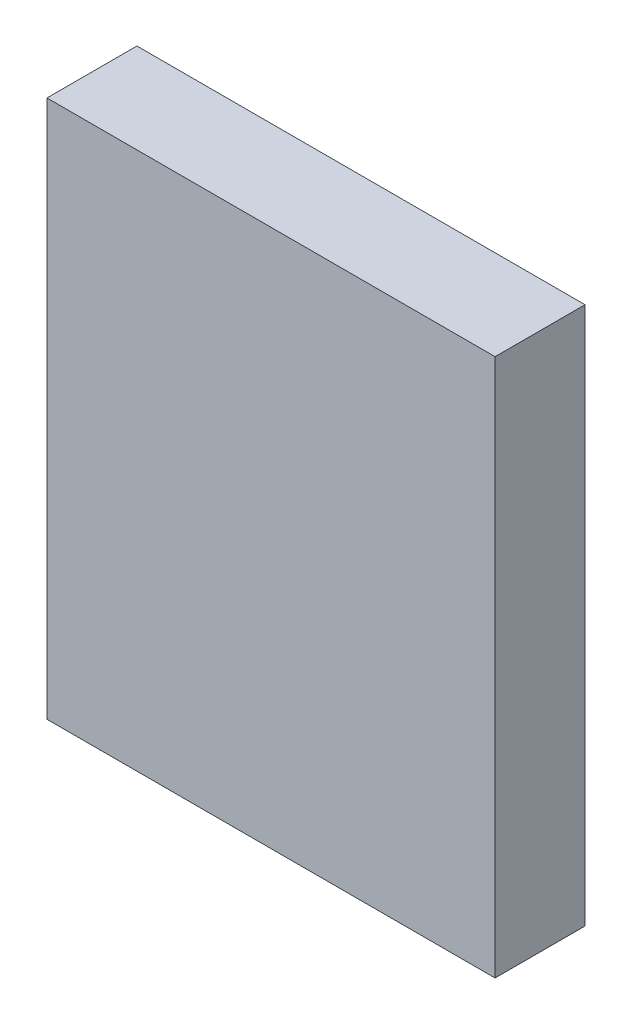
ISO-10303-21;
HEADER;
FILE_DESCRIPTION(('STEP AP214'),'2;1');
FILE_NAME('part.step','',(''),(''),'','','');
FILE_SCHEMA(('AUTOMOTIVE_DESIGN { 1 0 10303 214 1 1 1 1 }'));
ENDSEC;
DATA;
#1=APPLICATION_CONTEXT('core data for automotive mechanical design processes');
#2=APPLICATION_PROTOCOL_DEFINITION('international standard','automotive_design',2000,#1);
#3=PRODUCT_CONTEXT('',#1,'mechanical');
#4=PRODUCT('Part','Part','',(#3));
#5=PRODUCT_RELATED_PRODUCT_CATEGORY('part','',(#4));
#6=PRODUCT_DEFINITION_FORMATION('','',#4);
#7=PRODUCT_DEFINITION_CONTEXT('part definition',#1,'design');
#8=PRODUCT_DEFINITION('design','',#6,#7);
#9=PRODUCT_DEFINITION_SHAPE('','',#8);
#10=(LENGTH_UNIT() NAMED_UNIT(*) SI_UNIT(.MILLI.,.METRE.));
#11=(NAMED_UNIT(*) PLANE_ANGLE_UNIT() SI_UNIT($,.RADIAN.));
#12=(NAMED_UNIT(*) SI_UNIT($,.STERADIAN.) SOLID_ANGLE_UNIT());
#13=UNCERTAINTY_MEASURE_WITH_UNIT(LENGTH_MEASURE(1.E-05),#10,'distance_accuracy_value','');
#14=(GEOMETRIC_REPRESENTATION_CONTEXT(3) GLOBAL_UNCERTAINTY_ASSIGNED_CONTEXT((#13)) GLOBAL_UNIT_ASSIGNED_CONTEXT((#10,
#11,#12)) REPRESENTATION_CONTEXT('',''));
#15=CARTESIAN_POINT('',(0.,0.,0.));
#16=DIRECTION('',(0.,0.,1.));
#17=DIRECTION('',(1.,0.,0.));
#18=AXIS2_PLACEMENT_3D('',#15,#16,#17);
#19=CARTESIAN_POINT('',(0.373,-1.003,0.));
#20=DIRECTION('',(0.,-1.,0.));
#21=DIRECTION('',(0.,0.,1.));
#22=AXIS2_PLACEMENT_3D('',#19,#20,#21);
#23=PLANE('',#22);
#24=DIRECTION('',(-1.,0.,0.));
#25=VECTOR('',#24,1.);
#26=CARTESIAN_POINT('',(0.627,-1.003,0.));
#27=LINE('',#26,#25);
#28=CARTESIAN_POINT('',(0.627,-1.003,0.));
#29=VERTEX_POINT('',#28);
#30=CARTESIAN_POINT('',(0.373,-1.003,0.));
#31=VERTEX_POINT('',#30);
#32=EDGE_CURVE('E11',#29,#31,#27,.T.);
#33=ORIENTED_EDGE('',*,*,#32,.F.);
#34=DIRECTION('',(0.,0.,-1.));
#35=VECTOR('',#34,1.);
#36=CARTESIAN_POINT('',(0.627,-1.003,0.051));
#37=LINE('',#36,#35);
#38=CARTESIAN_POINT('',(0.627,-1.003,0.051));
#39=VERTEX_POINT('',#38);
#40=EDGE_CURVE('E24',#39,#29,#37,.T.);
#41=ORIENTED_EDGE('',*,*,#40,.F.);
#42=DIRECTION('',(1.,0.,0.));
#43=VECTOR('',#42,1.);
#44=CARTESIAN_POINT('',(0.373,-1.003,0.051));
#45=LINE('',#44,#43);
#46=CARTESIAN_POINT('',(0.373,-1.003,0.051));
#47=VERTEX_POINT('',#46);
#48=EDGE_CURVE('E88',#47,#39,#45,.T.);
#49=ORIENTED_EDGE('',*,*,#48,.F.);
#50=DIRECTION('',(0.,0.,1.));
#51=VECTOR('',#50,1.);
#52=CARTESIAN_POINT('',(0.373,-1.003,0.));
#53=LINE('',#52,#51);
#54=EDGE_CURVE('E77',#31,#47,#53,.T.);
#55=ORIENTED_EDGE('',*,*,#54,.F.);
#56=EDGE_LOOP('',(#33,#41,#49,#55));
#57=FACE_BOUND('',#56,.T.);
#58=ADVANCED_FACE('F17',(#57),#23,.T.);
#59=CARTESIAN_POINT('',(0.627,-1.003,0.));
#60=DIRECTION('',(1.,0.,0.));
#61=DIRECTION('',(0.,0.,1.));
#62=AXIS2_PLACEMENT_3D('',#59,#60,#61);
#63=PLANE('',#62);
#64=DIRECTION('',(0.,-1.,0.));
#65=VECTOR('',#64,1.);
#66=CARTESIAN_POINT('',(0.627,-0.698,0.));
#67=LINE('',#66,#65);
#68=CARTESIAN_POINT('',(0.627,-0.698,0.));
#69=VERTEX_POINT('',#68);
#70=EDGE_CURVE('E85',#69,#29,#67,.T.);
#71=ORIENTED_EDGE('',*,*,#70,.F.);
#72=DIRECTION('',(0.,0.,-1.));
#73=VECTOR('',#72,1.);
#74=CARTESIAN_POINT('',(0.627,-0.698,0.051));
#75=LINE('',#74,#73);
#76=CARTESIAN_POINT('',(0.627,-0.698,0.051));
#77=VERTEX_POINT('',#76);
#78=EDGE_CURVE('E83',#77,#69,#75,.T.);
#79=ORIENTED_EDGE('',*,*,#78,.F.);
#80=DIRECTION('',(0.,1.,0.));
#81=VECTOR('',#80,1.);
#82=CARTESIAN_POINT('',(0.627,-1.003,0.051));
#83=LINE('',#82,#81);
#84=EDGE_CURVE('E72',#39,#77,#83,.T.);
#85=ORIENTED_EDGE('',*,*,#84,.F.);
#86=ORIENTED_EDGE('',*,*,#40,.T.);
#87=EDGE_LOOP('',(#71,#79,#85,#86));
#88=FACE_BOUND('',#87,.T.);
#89=ADVANCED_FACE('F90',(#88),#63,.T.);
#90=CARTESIAN_POINT('',(0.627,-0.698,0.));
#91=DIRECTION('',(0.,1.,0.));
#92=DIRECTION('',(0.,0.,1.));
#93=AXIS2_PLACEMENT_3D('',#90,#91,#92);
#94=PLANE('',#93);
#95=DIRECTION('',(1.,0.,0.));
#96=VECTOR('',#95,1.);
#97=CARTESIAN_POINT('',(0.373,-0.698,0.));
#98=LINE('',#97,#96);
#99=CARTESIAN_POINT('',(0.373,-0.698,0.));
#100=VERTEX_POINT('',#99);
#101=EDGE_CURVE('E60',#100,#69,#98,.T.);
#102=ORIENTED_EDGE('',*,*,#101,.F.);
#103=DIRECTION('',(0.,0.,-1.));
#104=VECTOR('',#103,1.);
#105=CARTESIAN_POINT('',(0.373,-0.698,0.051));
#106=LINE('',#105,#104);
#107=CARTESIAN_POINT('',(0.373,-0.698,0.051));
#108=VERTEX_POINT('',#107);
#109=EDGE_CURVE('E54',#108,#100,#106,.T.);
#110=ORIENTED_EDGE('',*,*,#109,.F.);
#111=DIRECTION('',(-1.,0.,0.));
#112=VECTOR('',#111,1.);
#113=CARTESIAN_POINT('',(0.627,-0.698,0.051));
#114=LINE('',#113,#112);
#115=EDGE_CURVE('E58',#77,#108,#114,.T.);
#116=ORIENTED_EDGE('',*,*,#115,.F.);
#117=ORIENTED_EDGE('',*,*,#78,.T.);
#118=EDGE_LOOP('',(#102,#110,#116,#117));
#119=FACE_BOUND('',#118,.T.);
#120=ADVANCED_FACE('F56',(#119),#94,.T.);
#121=CARTESIAN_POINT('',(0.373,-0.698,0.));
#122=DIRECTION('',(-1.,0.,0.));
#123=DIRECTION('',(0.,0.,1.));
#124=AXIS2_PLACEMENT_3D('',#121,#122,#123);
#125=PLANE('',#124);
#126=DIRECTION('',(0.,1.,0.));
#127=VECTOR('',#126,1.);
#128=CARTESIAN_POINT('',(0.373,-1.003,0.));
#129=LINE('',#128,#127);
#130=EDGE_CURVE('E73',#31,#100,#129,.T.);
#131=ORIENTED_EDGE('',*,*,#130,.F.);
#132=ORIENTED_EDGE('',*,*,#54,.T.);
#133=DIRECTION('',(0.,-1.,0.));
#134=VECTOR('',#133,1.);
#135=CARTESIAN_POINT('',(0.373,-0.698,0.051));
#136=LINE('',#135,#134);
#137=EDGE_CURVE('E70',#108,#47,#136,.T.);
#138=ORIENTED_EDGE('',*,*,#137,.F.);
#139=ORIENTED_EDGE('',*,*,#109,.T.);
#140=EDGE_LOOP('',(#131,#132,#138,#139));
#141=FACE_BOUND('',#140,.T.);
#142=ADVANCED_FACE('F76',(#141),#125,.T.);
#143=CARTESIAN_POINT('',(0.373,-0.698,0.));
#144=DIRECTION('',(0.,0.,-1.));
#145=DIRECTION('',(0.,1.,0.));
#146=AXIS2_PLACEMENT_3D('',#143,#144,#145);
#147=PLANE('',#146);
#148=ORIENTED_EDGE('',*,*,#101,.T.);
#149=ORIENTED_EDGE('',*,*,#70,.T.);
#150=ORIENTED_EDGE('',*,*,#32,.T.);
#151=ORIENTED_EDGE('',*,*,#130,.T.);
#152=EDGE_LOOP('',(#148,#149,#150,#151));
#153=FACE_BOUND('',#152,.T.);
#154=ADVANCED_FACE('F91',(#153),#147,.T.);
#155=CARTESIAN_POINT('',(0.373,-1.003,0.051));
#156=DIRECTION('',(0.,0.,1.));
#157=DIRECTION('',(0.,1.,0.));
#158=AXIS2_PLACEMENT_3D('',#155,#156,#157);
#159=PLANE('',#158);
#160=ORIENTED_EDGE('',*,*,#48,.T.);
#161=ORIENTED_EDGE('',*,*,#84,.T.);
#162=ORIENTED_EDGE('',*,*,#115,.T.);
#163=ORIENTED_EDGE('',*,*,#137,.T.);
#164=EDGE_LOOP('',(#160,#161,#162,#163));
#165=FACE_BOUND('',#164,.T.);
#166=ADVANCED_FACE('F69',(#165),#159,.T.);
#167=CLOSED_SHELL('',(#58,#89,#120,#142,#154,#166));
#168=MANIFOLD_SOLID_BREP('B1',#167);
#169=ADVANCED_BREP_SHAPE_REPRESENTATION('',(#18,#168),#14);
#170=SHAPE_DEFINITION_REPRESENTATION(#9,#169);
ENDSEC;
END-ISO-10303-21;
